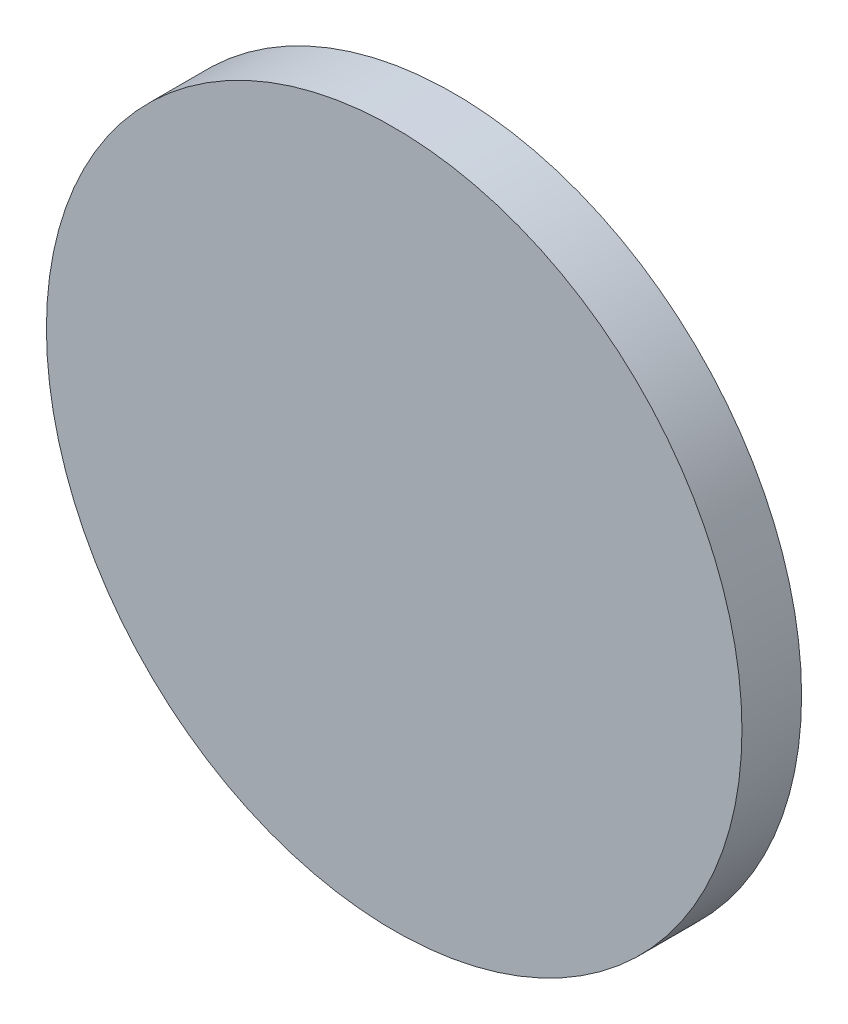
ISO-10303-21;
HEADER;
FILE_DESCRIPTION(('STEP AP214'),'2;1');
FILE_NAME('part.step','',(''),(''),'','','');
FILE_SCHEMA(('AUTOMOTIVE_DESIGN { 1 0 10303 214 1 1 1 1 }'));
ENDSEC;
DATA;
#1=APPLICATION_CONTEXT('core data for automotive mechanical design processes');
#2=APPLICATION_PROTOCOL_DEFINITION('international standard','automotive_design',2000,#1);
#3=PRODUCT_CONTEXT('',#1,'mechanical');
#4=PRODUCT('Part','Part','',(#3));
#5=PRODUCT_RELATED_PRODUCT_CATEGORY('part','',(#4));
#6=PRODUCT_DEFINITION_FORMATION('','',#4);
#7=PRODUCT_DEFINITION_CONTEXT('part definition',#1,'design');
#8=PRODUCT_DEFINITION('design','',#6,#7);
#9=PRODUCT_DEFINITION_SHAPE('','',#8);
#10=(LENGTH_UNIT() NAMED_UNIT(*) SI_UNIT(.MILLI.,.METRE.));
#11=(NAMED_UNIT(*) PLANE_ANGLE_UNIT() SI_UNIT($,.RADIAN.));
#12=(NAMED_UNIT(*) SI_UNIT($,.STERADIAN.) SOLID_ANGLE_UNIT());
#13=UNCERTAINTY_MEASURE_WITH_UNIT(LENGTH_MEASURE(1.E-05),#10,'distance_accuracy_value','');
#14=(GEOMETRIC_REPRESENTATION_CONTEXT(3) GLOBAL_UNCERTAINTY_ASSIGNED_CONTEXT((#13)) GLOBAL_UNIT_ASSIGNED_CONTEXT((#10,
#11,#12)) REPRESENTATION_CONTEXT('',''));
#15=CARTESIAN_POINT('',(0.,0.,0.));
#16=DIRECTION('',(0.,0.,1.));
#17=DIRECTION('',(1.,0.,0.));
#18=AXIS2_PLACEMENT_3D('',#15,#16,#17);
#19=CARTESIAN_POINT('',(11.90008,10.900000014875,0.));
#20=DIRECTION('',(0.,0.,-1.));
#21=DIRECTION('',(-1.,0.,0.));
#22=AXIS2_PLACEMENT_3D('',#19,#20,#21);
#23=PLANE('',#22);
#24=CARTESIAN_POINT('',(11.90008,10.900000014875,0.));
#25=DIRECTION('',(0.,0.,1.));
#26=DIRECTION('',(1.,0.,0.));
#27=AXIS2_PLACEMENT_3D('',#24,#25,#26);
#28=CIRCLE('',#27,0.200024667);
#29=CARTESIAN_POINT('',(12.100104667,10.900000014875,0.));
#30=VERTEX_POINT('',#29);
#31=EDGE_CURVE('E18',#30,#30,#28,.T.);
#32=ORIENTED_EDGE('',*,*,#31,.F.);
#33=EDGE_LOOP('',(#32));
#34=FACE_BOUND('',#33,.T.);
#35=ADVANCED_FACE('F15',(#34),#23,.T.);
#36=CARTESIAN_POINT('',(11.90008,10.900000014875,0.));
#37=DIRECTION('',(0.,0.,1.));
#38=DIRECTION('',(1.,0.,0.));
#39=AXIS2_PLACEMENT_3D('',#36,#37,#38);
#40=CYLINDRICAL_SURFACE('',#39,0.200024667);
#41=CARTESIAN_POINT('',(11.90008,10.900000014875,0.03429));
#42=DIRECTION('',(0.,0.,1.));
#43=DIRECTION('',(1.,0.,0.));
#44=AXIS2_PLACEMENT_3D('',#41,#42,#43);
#45=CIRCLE('',#44,0.200024667);
#46=CARTESIAN_POINT('',(12.100104667,10.900000014875,0.03429));
#47=VERTEX_POINT('',#46);
#48=EDGE_CURVE('E10',#47,#47,#45,.T.);
#49=ORIENTED_EDGE('',*,*,#48,.F.);
#50=EDGE_LOOP('',(#49));
#51=FACE_BOUND('',#50,.T.);
#52=ORIENTED_EDGE('',*,*,#31,.T.);
#53=EDGE_LOOP('',(#52));
#54=FACE_BOUND('',#53,.T.);
#55=ADVANCED_FACE('F27',(#51,#54),#40,.T.);
#56=CARTESIAN_POINT('',(11.90008,10.900000014875,0.03429));
#57=DIRECTION('',(0.,0.,1.));
#58=DIRECTION('',(1.,0.,0.));
#59=AXIS2_PLACEMENT_3D('',#56,#57,#58);
#60=PLANE('',#59);
#61=ORIENTED_EDGE('',*,*,#48,.T.);
#62=EDGE_LOOP('',(#61));
#63=FACE_BOUND('',#62,.T.);
#64=ADVANCED_FACE('F34',(#63),#60,.T.);
#65=CLOSED_SHELL('',(#35,#55,#64));
#66=MANIFOLD_SOLID_BREP('B1',#65);
#67=ADVANCED_BREP_SHAPE_REPRESENTATION('',(#18,#66),#14);
#68=SHAPE_DEFINITION_REPRESENTATION(#9,#67);
ENDSEC;
END-ISO-10303-21;
